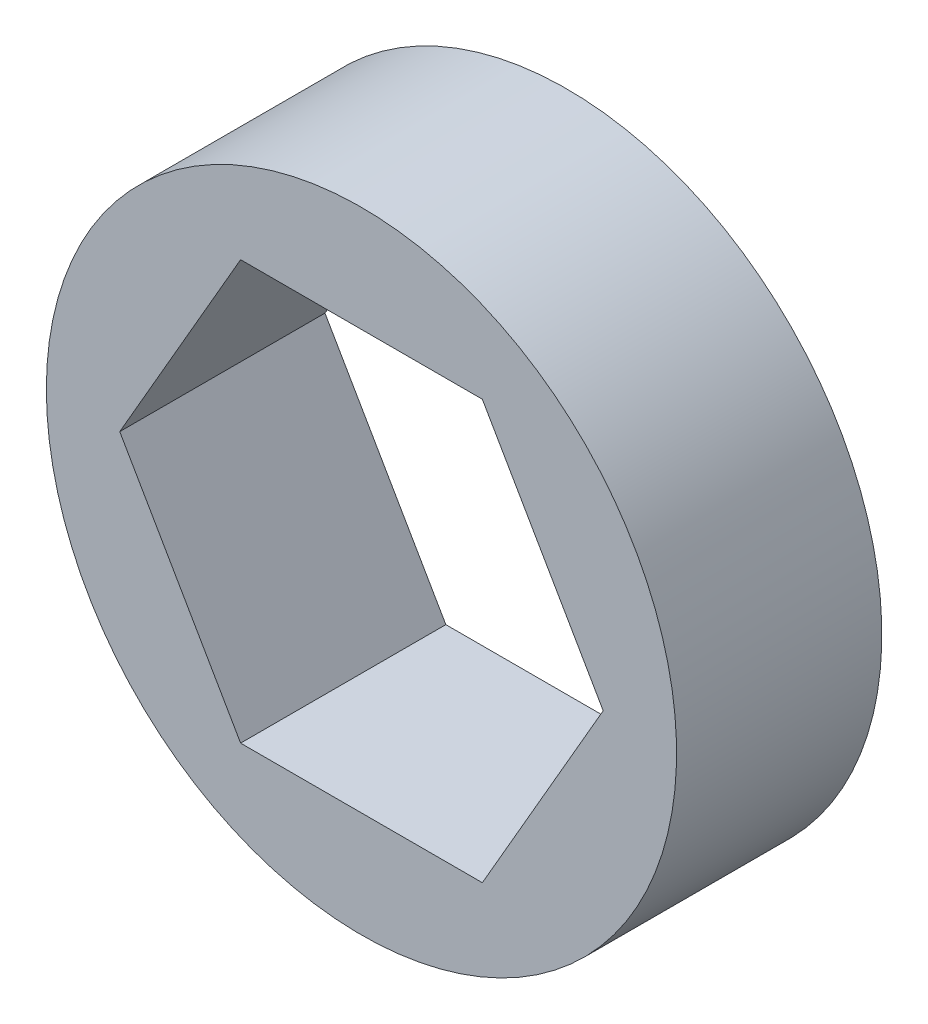
ISO-10303-21;
HEADER;
FILE_DESCRIPTION(('STEP AP214'),'2;1');
FILE_NAME('part.step','',(''),(''),'','','');
FILE_SCHEMA(('AUTOMOTIVE_DESIGN { 1 0 10303 214 1 1 1 1 }'));
ENDSEC;
DATA;
#1=APPLICATION_CONTEXT('core data for automotive mechanical design processes');
#2=APPLICATION_PROTOCOL_DEFINITION('international standard','automotive_design',2000,#1);
#3=PRODUCT_CONTEXT('',#1,'mechanical');
#4=PRODUCT('Part','Part','',(#3));
#5=PRODUCT_RELATED_PRODUCT_CATEGORY('part','',(#4));
#6=PRODUCT_DEFINITION_FORMATION('','',#4);
#7=PRODUCT_DEFINITION_CONTEXT('part definition',#1,'design');
#8=PRODUCT_DEFINITION('design','',#6,#7);
#9=PRODUCT_DEFINITION_SHAPE('','',#8);
#10=(LENGTH_UNIT() NAMED_UNIT(*) SI_UNIT(.MILLI.,.METRE.));
#11=(NAMED_UNIT(*) PLANE_ANGLE_UNIT() SI_UNIT($,.RADIAN.));
#12=(NAMED_UNIT(*) SI_UNIT($,.STERADIAN.) SOLID_ANGLE_UNIT());
#13=UNCERTAINTY_MEASURE_WITH_UNIT(LENGTH_MEASURE(1.E-05),#10,'distance_accuracy_value','');
#14=(GEOMETRIC_REPRESENTATION_CONTEXT(3) GLOBAL_UNCERTAINTY_ASSIGNED_CONTEXT((#13)) GLOBAL_UNIT_ASSIGNED_CONTEXT((#10,
#11,#12)) REPRESENTATION_CONTEXT('',''));
#15=CARTESIAN_POINT('',(0.,0.,0.));
#16=DIRECTION('',(0.,0.,1.));
#17=DIRECTION('',(1.,0.,0.));
#18=AXIS2_PLACEMENT_3D('',#15,#16,#17);
#19=CARTESIAN_POINT('',(-7.47899538708241,0.,3.175));
#20=DIRECTION('',(0.866025403784439,0.5,0.));
#21=DIRECTION('',(-0.5,0.866025403784439,0.));
#22=AXIS2_PLACEMENT_3D('',#19,#20,#21);
#23=PLANE('',#22);
#24=DIRECTION('',(-0.5,0.866025403784438,0.));
#25=VECTOR('',#24,1.);
#26=CARTESIAN_POINT('',(-3.73949769354121,-6.477,3.175));
#27=LINE('',#26,#25);
#28=CARTESIAN_POINT('',(-3.73949769354121,-6.477,3.175));
#29=VERTEX_POINT('',#28);
#30=CARTESIAN_POINT('',(-7.47899538708241,0.,3.175));
#31=VERTEX_POINT('',#30);
#32=EDGE_CURVE('E88',#29,#31,#27,.T.);
#33=ORIENTED_EDGE('',*,*,#32,.F.);
#34=DIRECTION('',(0.,0.,1.));
#35=VECTOR('',#34,1.);
#36=CARTESIAN_POINT('',(-3.73949769354121,-6.477,3.175));
#37=LINE('',#36,#35);
#38=CARTESIAN_POINT('',(-3.73949769354121,-6.477,-3.175));
#39=VERTEX_POINT('',#38);
#40=EDGE_CURVE('E79',#39,#29,#37,.T.);
#41=ORIENTED_EDGE('',*,*,#40,.F.);
#42=DIRECTION('',(-0.5,0.866025403784439,0.));
#43=VECTOR('',#42,1.);
#44=CARTESIAN_POINT('',(-3.73949769354121,-6.477,-3.175));
#45=LINE('',#44,#43);
#46=CARTESIAN_POINT('',(-7.47899538708241,0.,-3.175));
#47=VERTEX_POINT('',#46);
#48=EDGE_CURVE('E127',#39,#47,#45,.T.);
#49=ORIENTED_EDGE('',*,*,#48,.T.);
#50=DIRECTION('',(0.,0.,1.));
#51=VECTOR('',#50,1.);
#52=CARTESIAN_POINT('',(-7.47899538708241,0.,3.175));
#53=LINE('',#52,#51);
#54=EDGE_CURVE('E111',#31,#47,#53,.F.);
#55=ORIENTED_EDGE('',*,*,#54,.F.);
#56=EDGE_LOOP('',(#33,#41,#49,#55));
#57=FACE_BOUND('',#56,.T.);
#58=ADVANCED_FACE('F18',(#57),#23,.T.);
#59=CARTESIAN_POINT('',(-3.73949769354121,6.477,3.175));
#60=DIRECTION('',(0.866025403784439,-0.5,0.));
#61=DIRECTION('',(0.5,0.866025403784439,0.));
#62=AXIS2_PLACEMENT_3D('',#59,#60,#61);
#63=PLANE('',#62);
#64=DIRECTION('',(0.5,0.866025403784439,0.));
#65=VECTOR('',#64,1.);
#66=CARTESIAN_POINT('',(-7.47899538708242,0.,3.175));
#67=LINE('',#66,#65);
#68=CARTESIAN_POINT('',(-3.73949769354121,6.477,3.175));
#69=VERTEX_POINT('',#68);
#70=EDGE_CURVE('E120',#31,#69,#67,.T.);
#71=ORIENTED_EDGE('',*,*,#70,.F.);
#72=ORIENTED_EDGE('',*,*,#54,.T.);
#73=DIRECTION('',(0.5,0.866025403784439,0.));
#74=VECTOR('',#73,1.);
#75=CARTESIAN_POINT('',(-7.47899538708241,0.,-3.175));
#76=LINE('',#75,#74);
#77=CARTESIAN_POINT('',(-3.73949769354121,6.477,-3.175));
#78=VERTEX_POINT('',#77);
#79=EDGE_CURVE('E118',#47,#78,#76,.T.);
#80=ORIENTED_EDGE('',*,*,#79,.T.);
#81=DIRECTION('',(0.,0.,1.));
#82=VECTOR('',#81,1.);
#83=CARTESIAN_POINT('',(-3.73949769354121,6.477,3.175));
#84=LINE('',#83,#82);
#85=EDGE_CURVE('E107',#69,#78,#84,.F.);
#86=ORIENTED_EDGE('',*,*,#85,.F.);
#87=EDGE_LOOP('',(#71,#72,#80,#86));
#88=FACE_BOUND('',#87,.T.);
#89=ADVANCED_FACE('F117',(#88),#63,.T.);
#90=CARTESIAN_POINT('',(3.7394976935412,6.477,3.175));
#91=DIRECTION('',(0.,-1.,0.));
#92=DIRECTION('',(1.,0.,0.));
#93=AXIS2_PLACEMENT_3D('',#90,#91,#92);
#94=PLANE('',#93);
#95=DIRECTION('',(1.,0.,0.));
#96=VECTOR('',#95,1.);
#97=CARTESIAN_POINT('',(0.,6.477,3.175));
#98=LINE('',#97,#96);
#99=CARTESIAN_POINT('',(3.7394976935412,6.477,3.175));
#100=VERTEX_POINT('',#99);
#101=EDGE_CURVE('E141',#69,#100,#98,.T.);
#102=ORIENTED_EDGE('',*,*,#101,.F.);
#103=ORIENTED_EDGE('',*,*,#85,.T.);
#104=DIRECTION('',(1.,0.,0.));
#105=VECTOR('',#104,1.);
#106=CARTESIAN_POINT('',(0.,6.477,-3.175));
#107=LINE('',#106,#105);
#108=CARTESIAN_POINT('',(3.7394976935412,6.477,-3.175));
#109=VERTEX_POINT('',#108);
#110=EDGE_CURVE('E129',#78,#109,#107,.T.);
#111=ORIENTED_EDGE('',*,*,#110,.T.);
#112=DIRECTION('',(0.,0.,1.));
#113=VECTOR('',#112,1.);
#114=CARTESIAN_POINT('',(3.7394976935412,6.47700000000001,3.175));
#115=LINE('',#114,#113);
#116=EDGE_CURVE('E103',#100,#109,#115,.F.);
#117=ORIENTED_EDGE('',*,*,#116,.F.);
#118=EDGE_LOOP('',(#102,#103,#111,#117));
#119=FACE_BOUND('',#118,.T.);
#120=ADVANCED_FACE('F157',(#119),#94,.T.);
#121=CARTESIAN_POINT('',(7.47899538708241,0.,3.175));
#122=DIRECTION('',(-0.866025403784439,-0.5,0.));
#123=DIRECTION('',(0.5,-0.866025403784439,0.));
#124=AXIS2_PLACEMENT_3D('',#121,#122,#123);
#125=PLANE('',#124);
#126=DIRECTION('',(0.5,-0.866025403784438,0.));
#127=VECTOR('',#126,1.);
#128=CARTESIAN_POINT('',(3.7394976935412,6.477,3.175));
#129=LINE('',#128,#127);
#130=CARTESIAN_POINT('',(7.47899538708242,0.,3.175));
#131=VERTEX_POINT('',#130);
#132=EDGE_CURVE('E93',#100,#131,#129,.T.);
#133=ORIENTED_EDGE('',*,*,#132,.F.);
#134=ORIENTED_EDGE('',*,*,#116,.T.);
#135=DIRECTION('',(0.5,-0.866025403784438,0.));
#136=VECTOR('',#135,1.);
#137=CARTESIAN_POINT('',(3.7394976935412,6.477,-3.175));
#138=LINE('',#137,#136);
#139=CARTESIAN_POINT('',(7.47899538708241,0.,-3.175));
#140=VERTEX_POINT('',#139);
#141=EDGE_CURVE('E134',#109,#140,#138,.T.);
#142=ORIENTED_EDGE('',*,*,#141,.T.);
#143=DIRECTION('',(0.,0.,1.));
#144=VECTOR('',#143,1.);
#145=CARTESIAN_POINT('',(7.47899538708242,0.,3.175));
#146=LINE('',#145,#144);
#147=EDGE_CURVE('E67',#131,#140,#146,.F.);
#148=ORIENTED_EDGE('',*,*,#147,.F.);
#149=EDGE_LOOP('',(#133,#134,#142,#148));
#150=FACE_BOUND('',#149,.T.);
#151=ADVANCED_FACE('F154',(#150),#125,.T.);
#152=CARTESIAN_POINT('',(3.73949769354121,-6.477,3.175));
#153=DIRECTION('',(-0.866025403784439,0.5,0.));
#154=DIRECTION('',(-0.5,-0.866025403784439,0.));
#155=AXIS2_PLACEMENT_3D('',#152,#153,#154);
#156=PLANE('',#155);
#157=DIRECTION('',(-0.5,-0.866025403784439,0.));
#158=VECTOR('',#157,1.);
#159=CARTESIAN_POINT('',(7.47899538708241,0.,3.175));
#160=LINE('',#159,#158);
#161=CARTESIAN_POINT('',(3.73949769354121,-6.477,3.175));
#162=VERTEX_POINT('',#161);
#163=EDGE_CURVE('E73',#131,#162,#160,.T.);
#164=ORIENTED_EDGE('',*,*,#163,.F.);
#165=ORIENTED_EDGE('',*,*,#147,.T.);
#166=DIRECTION('',(-0.5,-0.866025403784439,0.));
#167=VECTOR('',#166,1.);
#168=CARTESIAN_POINT('',(7.47899538708241,0.,-3.175));
#169=LINE('',#168,#167);
#170=CARTESIAN_POINT('',(3.73949769354121,-6.477,-3.175));
#171=VERTEX_POINT('',#170);
#172=EDGE_CURVE('E35',#140,#171,#169,.T.);
#173=ORIENTED_EDGE('',*,*,#172,.T.);
#174=DIRECTION('',(0.,0.,1.));
#175=VECTOR('',#174,1.);
#176=CARTESIAN_POINT('',(3.73949769354121,-6.477,3.175));
#177=LINE('',#176,#175);
#178=EDGE_CURVE('E69',#162,#171,#177,.F.);
#179=ORIENTED_EDGE('',*,*,#178,.F.);
#180=EDGE_LOOP('',(#164,#165,#173,#179));
#181=FACE_BOUND('',#180,.T.);
#182=ADVANCED_FACE('F71',(#181),#156,.T.);
#183=CARTESIAN_POINT('',(-3.73949769354121,-6.477,3.175));
#184=DIRECTION('',(0.,1.,0.));
#185=DIRECTION('',(0.,0.,1.));
#186=AXIS2_PLACEMENT_3D('',#183,#184,#185);
#187=PLANE('',#186);
#188=DIRECTION('',(1.,0.,0.));
#189=VECTOR('',#188,1.);
#190=CARTESIAN_POINT('',(0.,-6.477,3.175));
#191=LINE('',#190,#189);
#192=EDGE_CURVE('E82',#162,#29,#191,.F.);
#193=ORIENTED_EDGE('',*,*,#192,.F.);
#194=ORIENTED_EDGE('',*,*,#178,.T.);
#195=DIRECTION('',(1.,0.,0.));
#196=VECTOR('',#195,1.);
#197=CARTESIAN_POINT('',(0.,-6.477,-3.175));
#198=LINE('',#197,#196);
#199=EDGE_CURVE('E146',#171,#39,#198,.F.);
#200=ORIENTED_EDGE('',*,*,#199,.T.);
#201=ORIENTED_EDGE('',*,*,#40,.T.);
#202=EDGE_LOOP('',(#193,#194,#200,#201));
#203=FACE_BOUND('',#202,.T.);
#204=ADVANCED_FACE('F83',(#203),#187,.T.);
#205=CARTESIAN_POINT('',(0.,0.,3.175));
#206=DIRECTION('',(0.,0.,1.));
#207=DIRECTION('',(1.,0.,0.));
#208=AXIS2_PLACEMENT_3D('',#205,#206,#207);
#209=PLANE('',#208);
#210=ORIENTED_EDGE('',*,*,#101,.T.);
#211=ORIENTED_EDGE('',*,*,#132,.T.);
#212=ORIENTED_EDGE('',*,*,#163,.T.);
#213=ORIENTED_EDGE('',*,*,#192,.T.);
#214=ORIENTED_EDGE('',*,*,#32,.T.);
#215=ORIENTED_EDGE('',*,*,#70,.T.);
#216=EDGE_LOOP('',(#210,#211,#212,#213,#214,#215));
#217=FACE_BOUND('',#216,.T.);
#218=CARTESIAN_POINT('',(0.,0.,3.175));
#219=DIRECTION('',(0.,0.,-1.));
#220=DIRECTION('',(-1.,0.,0.));
#221=AXIS2_PLACEMENT_3D('',#218,#219,#220);
#222=CIRCLE('',#221,9.75);
#223=CARTESIAN_POINT('',(-9.75,0.,3.175));
#224=VERTEX_POINT('',#223);
#225=EDGE_CURVE('E21',#224,#224,#222,.T.);
#226=ORIENTED_EDGE('',*,*,#225,.F.);
#227=EDGE_LOOP('',(#226));
#228=FACE_BOUND('',#227,.T.);
#229=ADVANCED_FACE('F91',(#217,#228),#209,.T.);
#230=CARTESIAN_POINT('',(0.,0.,-3.175));
#231=DIRECTION('',(0.,0.,1.));
#232=DIRECTION('',(1.,0.,0.));
#233=AXIS2_PLACEMENT_3D('',#230,#231,#232);
#234=PLANE('',#233);
#235=ORIENTED_EDGE('',*,*,#172,.F.);
#236=ORIENTED_EDGE('',*,*,#141,.F.);
#237=ORIENTED_EDGE('',*,*,#110,.F.);
#238=ORIENTED_EDGE('',*,*,#79,.F.);
#239=ORIENTED_EDGE('',*,*,#48,.F.);
#240=ORIENTED_EDGE('',*,*,#199,.F.);
#241=EDGE_LOOP('',(#235,#236,#237,#238,#239,#240));
#242=FACE_BOUND('',#241,.T.);
#243=CARTESIAN_POINT('',(0.,0.,-3.175));
#244=DIRECTION('',(0.,0.,-1.));
#245=DIRECTION('',(-1.,0.,0.));
#246=AXIS2_PLACEMENT_3D('',#243,#244,#245);
#247=CIRCLE('',#246,9.75);
#248=CARTESIAN_POINT('',(-9.75,0.,-3.175));
#249=VERTEX_POINT('',#248);
#250=EDGE_CURVE('E11',#249,#249,#247,.F.);
#251=ORIENTED_EDGE('',*,*,#250,.F.);
#252=EDGE_LOOP('',(#251));
#253=FACE_BOUND('',#252,.T.);
#254=ADVANCED_FACE('F125',(#242,#253),#234,.F.);
#255=CARTESIAN_POINT('',(0.,0.,3.175));
#256=DIRECTION('',(0.,0.,-1.));
#257=DIRECTION('',(-1.,0.,0.));
#258=AXIS2_PLACEMENT_3D('',#255,#256,#257);
#259=CYLINDRICAL_SURFACE('',#258,9.75);
#260=ORIENTED_EDGE('',*,*,#250,.T.);
#261=EDGE_LOOP('',(#260));
#262=FACE_BOUND('',#261,.T.);
#263=ORIENTED_EDGE('',*,*,#225,.T.);
#264=EDGE_LOOP('',(#263));
#265=FACE_BOUND('',#264,.T.);
#266=ADVANCED_FACE('F166',(#262,#265),#259,.T.);
#267=CLOSED_SHELL('',(#58,#89,#120,#151,#182,#204,#229,#254,#266));
#268=MANIFOLD_SOLID_BREP('B1',#267);
#269=ADVANCED_BREP_SHAPE_REPRESENTATION('',(#18,#268),#14);
#270=SHAPE_DEFINITION_REPRESENTATION(#9,#269);
ENDSEC;
END-ISO-10303-21;
